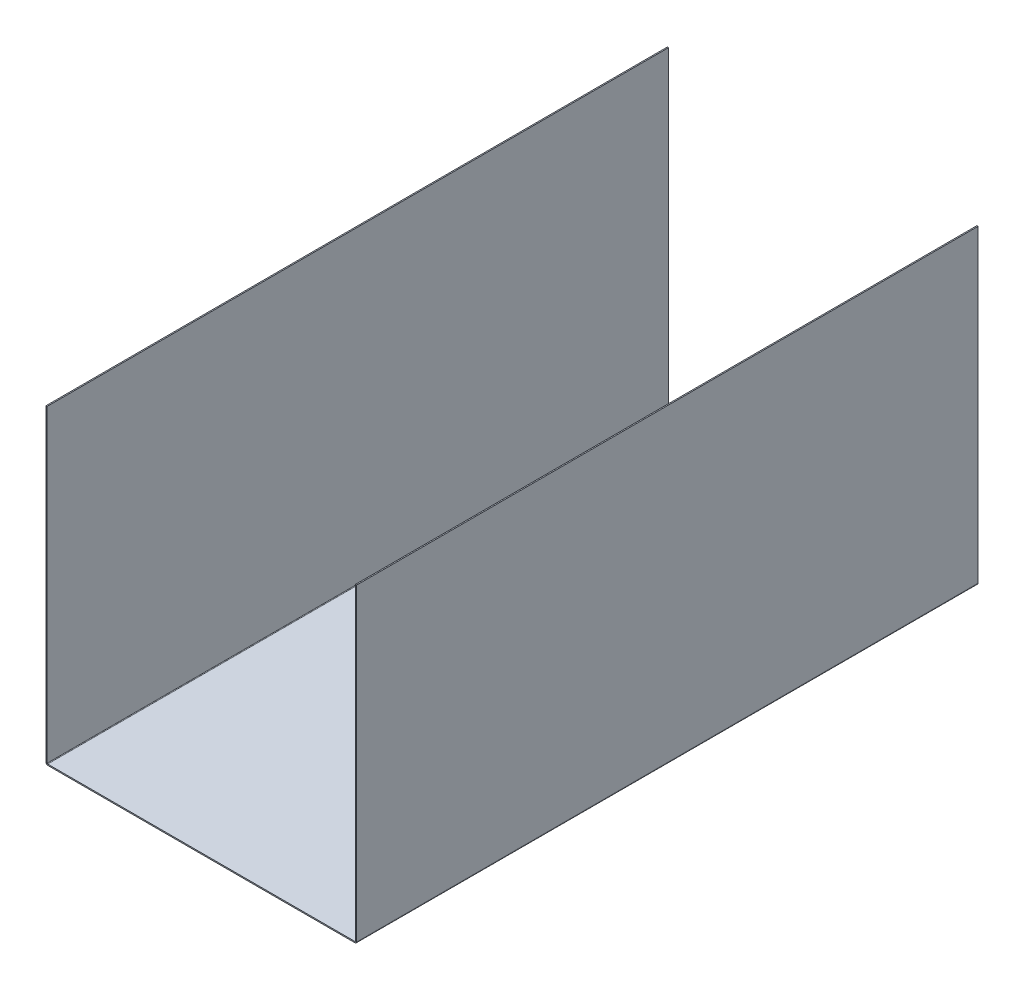
ISO-10303-21;
HEADER;
FILE_DESCRIPTION(('STEP AP214'),'2;1');
FILE_NAME('part.step','',(''),(''),'','','');
FILE_SCHEMA(('AUTOMOTIVE_DESIGN { 1 0 10303 214 1 1 1 1 }'));
ENDSEC;
DATA;
#1=APPLICATION_CONTEXT('core data for automotive mechanical design processes');
#2=APPLICATION_PROTOCOL_DEFINITION('international standard','automotive_design',2000,#1);
#3=PRODUCT_CONTEXT('',#1,'mechanical');
#4=PRODUCT('Part','Part','',(#3));
#5=PRODUCT_RELATED_PRODUCT_CATEGORY('part','',(#4));
#6=PRODUCT_DEFINITION_FORMATION('','',#4);
#7=PRODUCT_DEFINITION_CONTEXT('part definition',#1,'design');
#8=PRODUCT_DEFINITION('design','',#6,#7);
#9=PRODUCT_DEFINITION_SHAPE('','',#8);
#10=(LENGTH_UNIT() NAMED_UNIT(*) SI_UNIT(.MILLI.,.METRE.));
#11=(NAMED_UNIT(*) PLANE_ANGLE_UNIT() SI_UNIT($,.RADIAN.));
#12=(NAMED_UNIT(*) SI_UNIT($,.STERADIAN.) SOLID_ANGLE_UNIT());
#13=UNCERTAINTY_MEASURE_WITH_UNIT(LENGTH_MEASURE(1.E-05),#10,'distance_accuracy_value','');
#14=(GEOMETRIC_REPRESENTATION_CONTEXT(3) GLOBAL_UNCERTAINTY_ASSIGNED_CONTEXT((#13)) GLOBAL_UNIT_ASSIGNED_CONTEXT((#10,
#11,#12)) REPRESENTATION_CONTEXT('',''));
#15=CARTESIAN_POINT('',(0.,0.,0.));
#16=DIRECTION('',(0.,0.,1.));
#17=DIRECTION('',(1.,0.,0.));
#18=AXIS2_PLACEMENT_3D('',#15,#16,#17);
#19=CARTESIAN_POINT('',(-200.,2.23659999999998,400.));
#20=DIRECTION('',(0.,0.,1.));
#21=DIRECTION('',(1.,0.,0.));
#22=AXIS2_PLACEMENT_3D('',#19,#20,#21);
#23=PLANE('',#22);
#24=DIRECTION('',(1.,0.,0.));
#25=VECTOR('',#24,1.);
#26=CARTESIAN_POINT('',(-200.,2.23659999999998,400.));
#27=LINE('',#26,#25);
#28=CARTESIAN_POINT('',(-200.,2.23659999999998,400.));
#29=VERTEX_POINT('',#28);
#30=CARTESIAN_POINT('',(-198.5,2.23659999999998,400.));
#31=VERTEX_POINT('',#30);
#32=EDGE_CURVE('E11',#29,#31,#27,.T.);
#33=ORIENTED_EDGE('',*,*,#32,.F.);
#34=CARTESIAN_POINT('',(-197.7634,2.23659999999999,400.));
#35=DIRECTION('',(0.,0.,-1.));
#36=DIRECTION('',(-1.,0.,0.));
#37=AXIS2_PLACEMENT_3D('',#34,#35,#36);
#38=CIRCLE('',#37,2.2366);
#39=CARTESIAN_POINT('',(-197.7634,0.,400.));
#40=VERTEX_POINT('',#39);
#41=EDGE_CURVE('E242',#40,#29,#38,.T.);
#42=ORIENTED_EDGE('',*,*,#41,.F.);
#43=DIRECTION('',(0.,-1.,0.));
#44=VECTOR('',#43,1.);
#45=CARTESIAN_POINT('',(-197.7634,1.49999999999999,400.));
#46=LINE('',#45,#44);
#47=CARTESIAN_POINT('',(-197.7634,1.49999999999999,400.));
#48=VERTEX_POINT('',#47);
#49=EDGE_CURVE('E45',#48,#40,#46,.T.);
#50=ORIENTED_EDGE('',*,*,#49,.F.);
#51=CARTESIAN_POINT('',(-197.7634,2.23659999999999,400.));
#52=DIRECTION('',(0.,0.,1.));
#53=DIRECTION('',(1.,0.,0.));
#54=AXIS2_PLACEMENT_3D('',#51,#52,#53);
#55=CIRCLE('',#54,0.7366);
#56=EDGE_CURVE('E169',#48,#31,#55,.F.);
#57=ORIENTED_EDGE('',*,*,#56,.T.);
#58=EDGE_LOOP('',(#33,#42,#50,#57));
#59=FACE_BOUND('',#58,.T.);
#60=ADVANCED_FACE('F37',(#59),#23,.T.);
#61=CARTESIAN_POINT('',(-197.7634,1.49999999999999,400.));
#62=DIRECTION('',(0.,0.,1.));
#63=DIRECTION('',(1.,0.,0.));
#64=AXIS2_PLACEMENT_3D('',#61,#62,#63);
#65=PLANE('',#64);
#66=DIRECTION('',(0.,1.,0.));
#67=VECTOR('',#66,1.);
#68=CARTESIAN_POINT('',(-200.,400.,400.));
#69=LINE('',#68,#67);
#70=CARTESIAN_POINT('',(-200.,400.,400.));
#71=VERTEX_POINT('',#70);
#72=EDGE_CURVE('E246',#29,#71,#69,.T.);
#73=ORIENTED_EDGE('',*,*,#72,.F.);
#74=ORIENTED_EDGE('',*,*,#32,.T.);
#75=DIRECTION('',(0.,1.,0.));
#76=VECTOR('',#75,1.);
#77=CARTESIAN_POINT('',(-198.5,400.,400.));
#78=LINE('',#77,#76);
#79=CARTESIAN_POINT('',(-198.5,400.,400.));
#80=VERTEX_POINT('',#79);
#81=EDGE_CURVE('E105',#31,#80,#78,.T.);
#82=ORIENTED_EDGE('',*,*,#81,.T.);
#83=DIRECTION('',(1.,0.,0.));
#84=VECTOR('',#83,1.);
#85=CARTESIAN_POINT('',(-200.,400.,400.));
#86=LINE('',#85,#84);
#87=EDGE_CURVE('E517',#71,#80,#86,.T.);
#88=ORIENTED_EDGE('',*,*,#87,.F.);
#89=EDGE_LOOP('',(#73,#74,#82,#88));
#90=FACE_BOUND('',#89,.T.);
#91=ADVANCED_FACE('F295',(#90),#65,.T.);
#92=CARTESIAN_POINT('',(-197.7634,0.,-400.));
#93=DIRECTION('',(0.,0.,-1.));
#94=DIRECTION('',(-1.,0.,0.));
#95=AXIS2_PLACEMENT_3D('',#92,#93,#94);
#96=PLANE('',#95);
#97=DIRECTION('',(0.,1.,0.));
#98=VECTOR('',#97,1.);
#99=CARTESIAN_POINT('',(-197.7634,0.,-400.));
#100=LINE('',#99,#98);
#101=CARTESIAN_POINT('',(-197.7634,0.,-400.));
#102=VERTEX_POINT('',#101);
#103=CARTESIAN_POINT('',(-197.7634,1.49999999999999,-400.));
#104=VERTEX_POINT('',#103);
#105=EDGE_CURVE('E92',#102,#104,#100,.T.);
#106=ORIENTED_EDGE('',*,*,#105,.F.);
#107=CARTESIAN_POINT('',(-197.7634,2.23659999999999,-400.));
#108=DIRECTION('',(0.,0.,-1.));
#109=DIRECTION('',(-1.,0.,0.));
#110=AXIS2_PLACEMENT_3D('',#107,#108,#109);
#111=CIRCLE('',#110,2.2366);
#112=CARTESIAN_POINT('',(-200.,2.23659999999998,-400.));
#113=VERTEX_POINT('',#112);
#114=EDGE_CURVE('E184',#102,#113,#111,.T.);
#115=ORIENTED_EDGE('',*,*,#114,.T.);
#116=DIRECTION('',(-1.,0.,0.));
#117=VECTOR('',#116,1.);
#118=CARTESIAN_POINT('',(-198.5,2.23659999999998,-400.));
#119=LINE('',#118,#117);
#120=CARTESIAN_POINT('',(-198.5,2.23659999999998,-400.));
#121=VERTEX_POINT('',#120);
#122=EDGE_CURVE('E99',#121,#113,#119,.T.);
#123=ORIENTED_EDGE('',*,*,#122,.F.);
#124=CARTESIAN_POINT('',(-197.7634,2.23659999999999,-400.));
#125=DIRECTION('',(0.,0.,1.));
#126=DIRECTION('',(1.,0.,0.));
#127=AXIS2_PLACEMENT_3D('',#124,#125,#126);
#128=CIRCLE('',#127,0.7366);
#129=EDGE_CURVE('E203',#104,#121,#128,.F.);
#130=ORIENTED_EDGE('',*,*,#129,.F.);
#131=EDGE_LOOP('',(#106,#115,#123,#130));
#132=FACE_BOUND('',#131,.T.);
#133=ADVANCED_FACE('F299',(#132),#96,.T.);
#134=CARTESIAN_POINT('',(-198.5,2.23659999999998,-400.));
#135=DIRECTION('',(0.,0.,-1.));
#136=DIRECTION('',(-1.,0.,0.));
#137=AXIS2_PLACEMENT_3D('',#134,#135,#136);
#138=PLANE('',#137);
#139=DIRECTION('',(-1.,0.,0.));
#140=VECTOR('',#139,1.);
#141=CARTESIAN_POINT('',(-200.,0.,-400.));
#142=LINE('',#141,#140);
#143=CARTESIAN_POINT('',(197.7634,0.,-400.));
#144=VERTEX_POINT('',#143);
#145=EDGE_CURVE('E186',#144,#102,#142,.T.);
#146=ORIENTED_EDGE('',*,*,#145,.T.);
#147=ORIENTED_EDGE('',*,*,#105,.T.);
#148=DIRECTION('',(-1.,0.,0.));
#149=VECTOR('',#148,1.);
#150=CARTESIAN_POINT('',(-200.,1.5,-400.));
#151=LINE('',#150,#149);
#152=CARTESIAN_POINT('',(197.7634,1.50000000000007,-400.));
#153=VERTEX_POINT('',#152);
#154=EDGE_CURVE('E201',#153,#104,#151,.T.);
#155=ORIENTED_EDGE('',*,*,#154,.F.);
#156=DIRECTION('',(0.,-1.,0.));
#157=VECTOR('',#156,1.);
#158=CARTESIAN_POINT('',(197.7634,1.50000000000007,-400.));
#159=LINE('',#158,#157);
#160=EDGE_CURVE('E229',#153,#144,#159,.T.);
#161=ORIENTED_EDGE('',*,*,#160,.T.);
#162=EDGE_LOOP('',(#146,#147,#155,#161));
#163=FACE_BOUND('',#162,.T.);
#164=ADVANCED_FACE('F272',(#163),#138,.T.);
#165=CARTESIAN_POINT('',(197.7634,0.,400.));
#166=DIRECTION('',(0.,0.,1.));
#167=DIRECTION('',(1.,0.,0.));
#168=AXIS2_PLACEMENT_3D('',#165,#166,#167);
#169=PLANE('',#168);
#170=DIRECTION('',(0.,1.,0.));
#171=VECTOR('',#170,1.);
#172=CARTESIAN_POINT('',(197.7634,0.,400.));
#173=LINE('',#172,#171);
#174=CARTESIAN_POINT('',(197.7634,0.,400.));
#175=VERTEX_POINT('',#174);
#176=CARTESIAN_POINT('',(197.7634,1.50000000000007,400.));
#177=VERTEX_POINT('',#176);
#178=EDGE_CURVE('E133',#175,#177,#173,.T.);
#179=ORIENTED_EDGE('',*,*,#178,.F.);
#180=CARTESIAN_POINT('',(197.7634,2.23660000000005,400.));
#181=DIRECTION('',(0.,0.,-1.));
#182=DIRECTION('',(-1.,0.,0.));
#183=AXIS2_PLACEMENT_3D('',#180,#181,#182);
#184=CIRCLE('',#183,2.2366);
#185=CARTESIAN_POINT('',(200.,2.23660000000003,400.));
#186=VERTEX_POINT('',#185);
#187=EDGE_CURVE('E249',#186,#175,#184,.T.);
#188=ORIENTED_EDGE('',*,*,#187,.F.);
#189=DIRECTION('',(1.,0.,0.));
#190=VECTOR('',#189,1.);
#191=CARTESIAN_POINT('',(198.5,2.23660000000005,400.));
#192=LINE('',#191,#190);
#193=CARTESIAN_POINT('',(198.5,2.23660000000005,400.));
#194=VERTEX_POINT('',#193);
#195=EDGE_CURVE('E145',#194,#186,#192,.T.);
#196=ORIENTED_EDGE('',*,*,#195,.F.);
#197=CARTESIAN_POINT('',(197.7634,2.23660000000005,400.));
#198=DIRECTION('',(0.,0.,1.));
#199=DIRECTION('',(1.,0.,0.));
#200=AXIS2_PLACEMENT_3D('',#197,#198,#199);
#201=CIRCLE('',#200,0.7366);
#202=EDGE_CURVE('E148',#194,#177,#201,.F.);
#203=ORIENTED_EDGE('',*,*,#202,.T.);
#204=EDGE_LOOP('',(#179,#188,#196,#203));
#205=FACE_BOUND('',#204,.T.);
#206=ADVANCED_FACE('F150',(#205),#169,.T.);
#207=CARTESIAN_POINT('',(198.5,2.23660000000005,400.));
#208=DIRECTION('',(0.,0.,1.));
#209=DIRECTION('',(1.,0.,0.));
#210=AXIS2_PLACEMENT_3D('',#207,#208,#209);
#211=PLANE('',#210);
#212=DIRECTION('',(-1.,0.,0.));
#213=VECTOR('',#212,1.);
#214=CARTESIAN_POINT('',(-200.,0.,400.));
#215=LINE('',#214,#213);
#216=EDGE_CURVE('E140',#175,#40,#215,.T.);
#217=ORIENTED_EDGE('',*,*,#216,.F.);
#218=ORIENTED_EDGE('',*,*,#178,.T.);
#219=DIRECTION('',(-1.,0.,0.));
#220=VECTOR('',#219,1.);
#221=CARTESIAN_POINT('',(-200.,1.5,400.));
#222=LINE('',#221,#220);
#223=EDGE_CURVE('E137',#177,#48,#222,.T.);
#224=ORIENTED_EDGE('',*,*,#223,.T.);
#225=ORIENTED_EDGE('',*,*,#49,.T.);
#226=EDGE_LOOP('',(#217,#218,#224,#225));
#227=FACE_BOUND('',#226,.T.);
#228=ADVANCED_FACE('F135',(#227),#211,.T.);
#229=CARTESIAN_POINT('',(200.,2.23660000000003,-400.));
#230=DIRECTION('',(0.,0.,-1.));
#231=DIRECTION('',(-1.,0.,0.));
#232=AXIS2_PLACEMENT_3D('',#229,#230,#231);
#233=PLANE('',#232);
#234=DIRECTION('',(-1.,0.,0.));
#235=VECTOR('',#234,1.);
#236=CARTESIAN_POINT('',(200.,2.23660000000003,-400.));
#237=LINE('',#236,#235);
#238=CARTESIAN_POINT('',(200.,2.23660000000003,-400.));
#239=VERTEX_POINT('',#238);
#240=CARTESIAN_POINT('',(198.5,2.23660000000005,-400.));
#241=VERTEX_POINT('',#240);
#242=EDGE_CURVE('E231',#239,#241,#237,.T.);
#243=ORIENTED_EDGE('',*,*,#242,.F.);
#244=CARTESIAN_POINT('',(197.7634,2.23660000000005,-400.));
#245=DIRECTION('',(0.,0.,-1.));
#246=DIRECTION('',(-1.,0.,0.));
#247=AXIS2_PLACEMENT_3D('',#244,#245,#246);
#248=CIRCLE('',#247,2.2366);
#249=EDGE_CURVE('E188',#239,#144,#248,.T.);
#250=ORIENTED_EDGE('',*,*,#249,.T.);
#251=ORIENTED_EDGE('',*,*,#160,.F.);
#252=CARTESIAN_POINT('',(197.7634,2.23660000000005,-400.));
#253=DIRECTION('',(0.,0.,1.));
#254=DIRECTION('',(1.,0.,0.));
#255=AXIS2_PLACEMENT_3D('',#252,#253,#254);
#256=CIRCLE('',#255,0.7366);
#257=EDGE_CURVE('E161',#241,#153,#256,.F.);
#258=ORIENTED_EDGE('',*,*,#257,.F.);
#259=EDGE_LOOP('',(#243,#250,#251,#258));
#260=FACE_BOUND('',#259,.T.);
#261=ADVANCED_FACE('F270',(#260),#233,.T.);
#262=CARTESIAN_POINT('',(197.7634,1.50000000000007,-400.));
#263=DIRECTION('',(0.,0.,-1.));
#264=DIRECTION('',(-1.,0.,0.));
#265=AXIS2_PLACEMENT_3D('',#262,#263,#264);
#266=PLANE('',#265);
#267=DIRECTION('',(0.,-1.,0.));
#268=VECTOR('',#267,1.);
#269=CARTESIAN_POINT('',(200.,400.,-400.));
#270=LINE('',#269,#268);
#271=CARTESIAN_POINT('',(200.,400.,-400.));
#272=VERTEX_POINT('',#271);
#273=EDGE_CURVE('E191',#272,#239,#270,.T.);
#274=ORIENTED_EDGE('',*,*,#273,.T.);
#275=ORIENTED_EDGE('',*,*,#242,.T.);
#276=DIRECTION('',(0.,-1.,0.));
#277=VECTOR('',#276,1.);
#278=CARTESIAN_POINT('',(198.5,400.,-400.));
#279=LINE('',#278,#277);
#280=CARTESIAN_POINT('',(198.5,400.,-400.));
#281=VERTEX_POINT('',#280);
#282=EDGE_CURVE('E197',#281,#241,#279,.T.);
#283=ORIENTED_EDGE('',*,*,#282,.F.);
#284=DIRECTION('',(1.,0.,0.));
#285=VECTOR('',#284,1.);
#286=CARTESIAN_POINT('',(198.5,400.,-400.));
#287=LINE('',#286,#285);
#288=EDGE_CURVE('E194',#281,#272,#287,.T.);
#289=ORIENTED_EDGE('',*,*,#288,.T.);
#290=EDGE_LOOP('',(#274,#275,#283,#289));
#291=FACE_BOUND('',#290,.T.);
#292=ADVANCED_FACE('F282',(#291),#266,.T.);
#293=CARTESIAN_POINT('',(-198.5,400.,400.));
#294=DIRECTION('',(-1.,0.,0.));
#295=DIRECTION('',(0.,-1.,0.));
#296=AXIS2_PLACEMENT_3D('',#293,#294,#295);
#297=PLANE('',#296);
#298=DIRECTION('',(0.,1.,0.));
#299=VECTOR('',#298,1.);
#300=CARTESIAN_POINT('',(-198.5,400.,-400.));
#301=LINE('',#300,#299);
#302=CARTESIAN_POINT('',(-198.5,400.,-400.));
#303=VERTEX_POINT('',#302);
#304=EDGE_CURVE('E175',#121,#303,#301,.T.);
#305=ORIENTED_EDGE('',*,*,#304,.T.);
#306=DIRECTION('',(0.,0.,-1.));
#307=VECTOR('',#306,1.);
#308=CARTESIAN_POINT('',(-198.5,400.,400.));
#309=LINE('',#308,#307);
#310=EDGE_CURVE('E227',#80,#303,#309,.T.);
#311=ORIENTED_EDGE('',*,*,#310,.F.);
#312=ORIENTED_EDGE('',*,*,#81,.F.);
#313=DIRECTION('',(0.,0.,-1.));
#314=VECTOR('',#313,1.);
#315=CARTESIAN_POINT('',(-198.5,2.23659999999998,400.));
#316=LINE('',#315,#314);
#317=EDGE_CURVE('E171',#31,#121,#316,.T.);
#318=ORIENTED_EDGE('',*,*,#317,.T.);
#319=EDGE_LOOP('',(#305,#311,#312,#318));
#320=FACE_BOUND('',#319,.T.);
#321=ADVANCED_FACE('F284',(#320),#297,.F.);
#322=CARTESIAN_POINT('',(-200.,400.,400.));
#323=DIRECTION('',(0.,1.,0.));
#324=DIRECTION('',(0.,0.,1.));
#325=AXIS2_PLACEMENT_3D('',#322,#323,#324);
#326=PLANE('',#325);
#327=DIRECTION('',(1.,0.,0.));
#328=VECTOR('',#327,1.);
#329=CARTESIAN_POINT('',(-200.,400.,-400.));
#330=LINE('',#329,#328);
#331=CARTESIAN_POINT('',(-200.,400.,-400.));
#332=VERTEX_POINT('',#331);
#333=EDGE_CURVE('E178',#332,#303,#330,.T.);
#334=ORIENTED_EDGE('',*,*,#333,.F.);
#335=DIRECTION('',(0.,0.,-1.));
#336=VECTOR('',#335,1.);
#337=CARTESIAN_POINT('',(-200.,400.,400.));
#338=LINE('',#337,#336);
#339=EDGE_CURVE('E225',#71,#332,#338,.T.);
#340=ORIENTED_EDGE('',*,*,#339,.F.);
#341=ORIENTED_EDGE('',*,*,#87,.T.);
#342=ORIENTED_EDGE('',*,*,#310,.T.);
#343=EDGE_LOOP('',(#334,#340,#341,#342));
#344=FACE_BOUND('',#343,.T.);
#345=ADVANCED_FACE('F290',(#344),#326,.T.);
#346=CARTESIAN_POINT('',(-200.,400.,400.));
#347=DIRECTION('',(-1.,0.,0.));
#348=DIRECTION('',(0.,-1.,0.));
#349=AXIS2_PLACEMENT_3D('',#346,#347,#348);
#350=PLANE('',#349);
#351=DIRECTION('',(0.,1.,0.));
#352=VECTOR('',#351,1.);
#353=CARTESIAN_POINT('',(-200.,400.,-400.));
#354=LINE('',#353,#352);
#355=EDGE_CURVE('E181',#113,#332,#354,.T.);
#356=ORIENTED_EDGE('',*,*,#355,.F.);
#357=DIRECTION('',(0.,0.,-1.));
#358=VECTOR('',#357,1.);
#359=CARTESIAN_POINT('',(-200.,2.23659999999998,400.));
#360=LINE('',#359,#358);
#361=EDGE_CURVE('E222',#29,#113,#360,.T.);
#362=ORIENTED_EDGE('',*,*,#361,.F.);
#363=ORIENTED_EDGE('',*,*,#72,.T.);
#364=ORIENTED_EDGE('',*,*,#339,.T.);
#365=EDGE_LOOP('',(#356,#362,#363,#364));
#366=FACE_BOUND('',#365,.T.);
#367=ADVANCED_FACE('F340',(#366),#350,.T.);
#368=CARTESIAN_POINT('',(-197.7634,2.23659999999999,400.));
#369=DIRECTION('',(0.,0.,-1.));
#370=DIRECTION('',(-1.,0.,0.));
#371=AXIS2_PLACEMENT_3D('',#368,#369,#370);
#372=CYLINDRICAL_SURFACE('',#371,2.2366);
#373=ORIENTED_EDGE('',*,*,#114,.F.);
#374=DIRECTION('',(0.,0.,-1.));
#375=VECTOR('',#374,1.);
#376=CARTESIAN_POINT('',(-197.7634,0.,400.));
#377=LINE('',#376,#375);
#378=EDGE_CURVE('E219',#40,#102,#377,.T.);
#379=ORIENTED_EDGE('',*,*,#378,.F.);
#380=ORIENTED_EDGE('',*,*,#41,.T.);
#381=ORIENTED_EDGE('',*,*,#361,.T.);
#382=EDGE_LOOP('',(#373,#379,#380,#381));
#383=FACE_BOUND('',#382,.T.);
#384=ADVANCED_FACE('F241',(#383),#372,.T.);
#385=CARTESIAN_POINT('',(-200.,0.,400.));
#386=DIRECTION('',(0.,-1.,0.));
#387=DIRECTION('',(1.,0.,0.));
#388=AXIS2_PLACEMENT_3D('',#385,#386,#387);
#389=PLANE('',#388);
#390=ORIENTED_EDGE('',*,*,#145,.F.);
#391=DIRECTION('',(0.,0.,-1.));
#392=VECTOR('',#391,1.);
#393=CARTESIAN_POINT('',(197.7634,0.,400.));
#394=LINE('',#393,#392);
#395=EDGE_CURVE('E216',#175,#144,#394,.T.);
#396=ORIENTED_EDGE('',*,*,#395,.F.);
#397=ORIENTED_EDGE('',*,*,#216,.T.);
#398=ORIENTED_EDGE('',*,*,#378,.T.);
#399=EDGE_LOOP('',(#390,#396,#397,#398));
#400=FACE_BOUND('',#399,.T.);
#401=ADVANCED_FACE('F248',(#400),#389,.T.);
#402=CARTESIAN_POINT('',(197.7634,2.23660000000005,400.));
#403=DIRECTION('',(0.,0.,-1.));
#404=DIRECTION('',(-1.,0.,0.));
#405=AXIS2_PLACEMENT_3D('',#402,#403,#404);
#406=CYLINDRICAL_SURFACE('',#405,2.2366);
#407=ORIENTED_EDGE('',*,*,#249,.F.);
#408=DIRECTION('',(0.,0.,-1.));
#409=VECTOR('',#408,1.);
#410=CARTESIAN_POINT('',(200.,2.23660000000003,400.));
#411=LINE('',#410,#409);
#412=EDGE_CURVE('E213',#186,#239,#411,.T.);
#413=ORIENTED_EDGE('',*,*,#412,.F.);
#414=ORIENTED_EDGE('',*,*,#187,.T.);
#415=ORIENTED_EDGE('',*,*,#395,.T.);
#416=EDGE_LOOP('',(#407,#413,#414,#415));
#417=FACE_BOUND('',#416,.T.);
#418=ADVANCED_FACE('F274',(#417),#406,.T.);
#419=CARTESIAN_POINT('',(200.,400.,400.));
#420=DIRECTION('',(1.,0.,0.));
#421=DIRECTION('',(0.,1.,0.));
#422=AXIS2_PLACEMENT_3D('',#419,#420,#421);
#423=PLANE('',#422);
#424=ORIENTED_EDGE('',*,*,#273,.F.);
#425=DIRECTION('',(0.,0.,-1.));
#426=VECTOR('',#425,1.);
#427=CARTESIAN_POINT('',(200.,400.,400.));
#428=LINE('',#427,#426);
#429=CARTESIAN_POINT('',(200.,400.,400.));
#430=VERTEX_POINT('',#429);
#431=EDGE_CURVE('E211',#430,#272,#428,.T.);
#432=ORIENTED_EDGE('',*,*,#431,.F.);
#433=DIRECTION('',(0.,-1.,0.));
#434=VECTOR('',#433,1.);
#435=CARTESIAN_POINT('',(200.,400.,400.));
#436=LINE('',#435,#434);
#437=EDGE_CURVE('E251',#430,#186,#436,.T.);
#438=ORIENTED_EDGE('',*,*,#437,.T.);
#439=ORIENTED_EDGE('',*,*,#412,.T.);
#440=EDGE_LOOP('',(#424,#432,#438,#439));
#441=FACE_BOUND('',#440,.T.);
#442=ADVANCED_FACE('F277',(#441),#423,.T.);
#443=CARTESIAN_POINT('',(198.5,400.,400.));
#444=DIRECTION('',(0.,1.,0.));
#445=DIRECTION('',(0.,0.,1.));
#446=AXIS2_PLACEMENT_3D('',#443,#444,#445);
#447=PLANE('',#446);
#448=ORIENTED_EDGE('',*,*,#288,.F.);
#449=DIRECTION('',(0.,0.,-1.));
#450=VECTOR('',#449,1.);
#451=CARTESIAN_POINT('',(198.5,400.,400.));
#452=LINE('',#451,#450);
#453=CARTESIAN_POINT('',(198.5,400.,400.));
#454=VERTEX_POINT('',#453);
#455=EDGE_CURVE('E209',#454,#281,#452,.T.);
#456=ORIENTED_EDGE('',*,*,#455,.F.);
#457=DIRECTION('',(1.,0.,0.));
#458=VECTOR('',#457,1.);
#459=CARTESIAN_POINT('',(198.5,400.,400.));
#460=LINE('',#459,#458);
#461=EDGE_CURVE('E257',#454,#430,#460,.T.);
#462=ORIENTED_EDGE('',*,*,#461,.T.);
#463=ORIENTED_EDGE('',*,*,#431,.T.);
#464=EDGE_LOOP('',(#448,#456,#462,#463));
#465=FACE_BOUND('',#464,.T.);
#466=ADVANCED_FACE('F280',(#465),#447,.T.);
#467=CARTESIAN_POINT('',(198.5,400.,400.));
#468=DIRECTION('',(1.,0.,0.));
#469=DIRECTION('',(0.,1.,0.));
#470=AXIS2_PLACEMENT_3D('',#467,#468,#469);
#471=PLANE('',#470);
#472=ORIENTED_EDGE('',*,*,#282,.T.);
#473=DIRECTION('',(0.,0.,-1.));
#474=VECTOR('',#473,1.);
#475=CARTESIAN_POINT('',(198.5,2.23660000000005,400.));
#476=LINE('',#475,#474);
#477=EDGE_CURVE('E163',#194,#241,#476,.T.);
#478=ORIENTED_EDGE('',*,*,#477,.F.);
#479=DIRECTION('',(0.,-1.,0.));
#480=VECTOR('',#479,1.);
#481=CARTESIAN_POINT('',(198.5,400.,400.));
#482=LINE('',#481,#480);
#483=EDGE_CURVE('E154',#454,#194,#482,.T.);
#484=ORIENTED_EDGE('',*,*,#483,.F.);
#485=ORIENTED_EDGE('',*,*,#455,.T.);
#486=EDGE_LOOP('',(#472,#478,#484,#485));
#487=FACE_BOUND('',#486,.T.);
#488=ADVANCED_FACE('F267',(#487),#471,.F.);
#489=CARTESIAN_POINT('',(197.7634,2.23660000000005,400.));
#490=DIRECTION('',(0.,0.,-1.));
#491=DIRECTION('',(-1.,0.,0.));
#492=AXIS2_PLACEMENT_3D('',#489,#490,#491);
#493=CYLINDRICAL_SURFACE('',#492,0.7366);
#494=ORIENTED_EDGE('',*,*,#257,.T.);
#495=DIRECTION('',(0.,0.,-1.));
#496=VECTOR('',#495,1.);
#497=CARTESIAN_POINT('',(197.7634,1.50000000000007,400.));
#498=LINE('',#497,#496);
#499=EDGE_CURVE('E158',#177,#153,#498,.T.);
#500=ORIENTED_EDGE('',*,*,#499,.F.);
#501=ORIENTED_EDGE('',*,*,#202,.F.);
#502=ORIENTED_EDGE('',*,*,#477,.T.);
#503=EDGE_LOOP('',(#494,#500,#501,#502));
#504=FACE_BOUND('',#503,.T.);
#505=ADVANCED_FACE('F159',(#504),#493,.F.);
#506=CARTESIAN_POINT('',(-200.,1.5,400.));
#507=DIRECTION('',(0.,-1.,0.));
#508=DIRECTION('',(1.,0.,0.));
#509=AXIS2_PLACEMENT_3D('',#506,#507,#508);
#510=PLANE('',#509);
#511=ORIENTED_EDGE('',*,*,#154,.T.);
#512=DIRECTION('',(0.,0.,-1.));
#513=VECTOR('',#512,1.);
#514=CARTESIAN_POINT('',(-197.7634,1.49999999999999,400.));
#515=LINE('',#514,#513);
#516=EDGE_CURVE('E164',#48,#104,#515,.T.);
#517=ORIENTED_EDGE('',*,*,#516,.F.);
#518=ORIENTED_EDGE('',*,*,#223,.F.);
#519=ORIENTED_EDGE('',*,*,#499,.T.);
#520=EDGE_LOOP('',(#511,#517,#518,#519));
#521=FACE_BOUND('',#520,.T.);
#522=ADVANCED_FACE('F166',(#521),#510,.F.);
#523=CARTESIAN_POINT('',(-197.7634,2.23659999999999,400.));
#524=DIRECTION('',(0.,0.,-1.));
#525=DIRECTION('',(-1.,0.,0.));
#526=AXIS2_PLACEMENT_3D('',#523,#524,#525);
#527=CYLINDRICAL_SURFACE('',#526,0.7366);
#528=ORIENTED_EDGE('',*,*,#129,.T.);
#529=ORIENTED_EDGE('',*,*,#317,.F.);
#530=ORIENTED_EDGE('',*,*,#56,.F.);
#531=ORIENTED_EDGE('',*,*,#516,.T.);
#532=EDGE_LOOP('',(#528,#529,#530,#531));
#533=FACE_BOUND('',#532,.T.);
#534=ADVANCED_FACE('F424',(#533),#527,.F.);
#535=CARTESIAN_POINT('',(-197.7634,2.23659999999999,400.));
#536=DIRECTION('',(0.,0.,-1.));
#537=DIRECTION('',(-1.,0.,0.));
#538=AXIS2_PLACEMENT_3D('',#535,#536,#537);
#539=PLANE('',#538);
#540=ORIENTED_EDGE('',*,*,#483,.T.);
#541=ORIENTED_EDGE('',*,*,#195,.T.);
#542=ORIENTED_EDGE('',*,*,#437,.F.);
#543=ORIENTED_EDGE('',*,*,#461,.F.);
#544=EDGE_LOOP('',(#540,#541,#542,#543));
#545=FACE_BOUND('',#544,.T.);
#546=ADVANCED_FACE('F263',(#545),#539,.F.);
#547=CARTESIAN_POINT('',(-197.7634,2.23659999999999,-400.));
#548=DIRECTION('',(0.,0.,-1.));
#549=DIRECTION('',(-1.,0.,0.));
#550=AXIS2_PLACEMENT_3D('',#547,#548,#549);
#551=PLANE('',#550);
#552=ORIENTED_EDGE('',*,*,#304,.F.);
#553=ORIENTED_EDGE('',*,*,#122,.T.);
#554=ORIENTED_EDGE('',*,*,#355,.T.);
#555=ORIENTED_EDGE('',*,*,#333,.T.);
#556=EDGE_LOOP('',(#552,#553,#554,#555));
#557=FACE_BOUND('',#556,.T.);
#558=ADVANCED_FACE('F444',(#557),#551,.T.);
#559=CLOSED_SHELL('',(#60,#91,#133,#164,#206,#228,#261,#292,#321,#345,#367,#384,#401,#418,#442,
#466,#488,#505,#522,#534,#546,#558));
#560=MANIFOLD_SOLID_BREP('B2',#559);
#561=ADVANCED_BREP_SHAPE_REPRESENTATION('',(#18,#560),#14);
#562=SHAPE_DEFINITION_REPRESENTATION(#9,#561);
ENDSEC;
END-ISO-10303-21;
